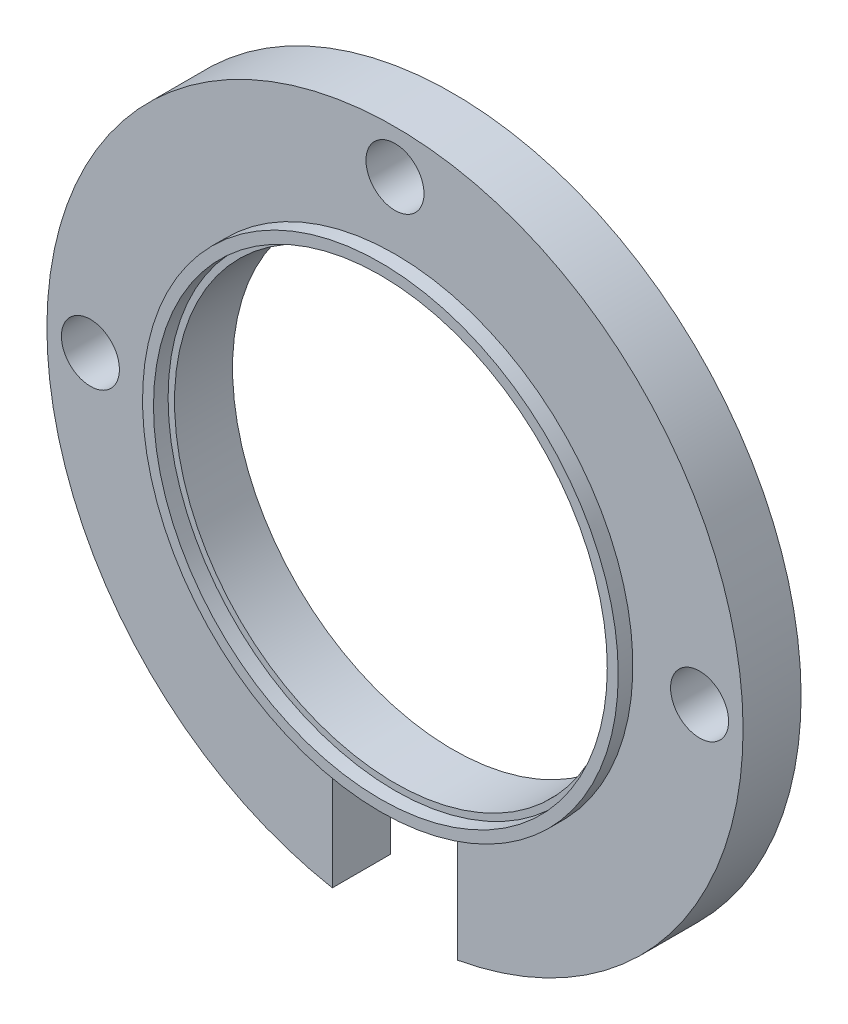
ISO-10303-21;
HEADER;
FILE_DESCRIPTION(('STEP AP214'),'2;1');
FILE_NAME('part.step','',(''),(''),'','','');
FILE_SCHEMA(('AUTOMOTIVE_DESIGN { 1 0 10303 214 1 1 1 1 }'));
ENDSEC;
DATA;
#1=APPLICATION_CONTEXT('core data for automotive mechanical design processes');
#2=APPLICATION_PROTOCOL_DEFINITION('international standard','automotive_design',2000,#1);
#3=PRODUCT_CONTEXT('',#1,'mechanical');
#4=PRODUCT('Part','Part','',(#3));
#5=PRODUCT_RELATED_PRODUCT_CATEGORY('part','',(#4));
#6=PRODUCT_DEFINITION_FORMATION('','',#4);
#7=PRODUCT_DEFINITION_CONTEXT('part definition',#1,'design');
#8=PRODUCT_DEFINITION('design','',#6,#7);
#9=PRODUCT_DEFINITION_SHAPE('','',#8);
#10=(LENGTH_UNIT() NAMED_UNIT(*) SI_UNIT(.MILLI.,.METRE.));
#11=(NAMED_UNIT(*) PLANE_ANGLE_UNIT() SI_UNIT($,.RADIAN.));
#12=(NAMED_UNIT(*) SI_UNIT($,.STERADIAN.) SOLID_ANGLE_UNIT());
#13=UNCERTAINTY_MEASURE_WITH_UNIT(LENGTH_MEASURE(1.E-05),#10,'distance_accuracy_value','');
#14=(GEOMETRIC_REPRESENTATION_CONTEXT(3) GLOBAL_UNCERTAINTY_ASSIGNED_CONTEXT((#13)) GLOBAL_UNIT_ASSIGNED_CONTEXT((#10,
#11,#12)) REPRESENTATION_CONTEXT('',''));
#15=CARTESIAN_POINT('',(0.,0.,0.));
#16=DIRECTION('',(0.,0.,1.));
#17=DIRECTION('',(1.,0.,0.));
#18=AXIS2_PLACEMENT_3D('',#15,#16,#17);
#19=CARTESIAN_POINT('',(0.,0.,3.175));
#20=DIRECTION('',(0.,0.,1.));
#21=DIRECTION('',(1.,0.,0.));
#22=AXIS2_PLACEMENT_3D('',#19,#20,#21);
#23=PLANE('',#22);
#24=CARTESIAN_POINT('',(0.,16.66875,3.175));
#25=DIRECTION('',(0.,0.,1.));
#26=DIRECTION('',(1.,0.,0.));
#27=AXIS2_PLACEMENT_3D('',#24,#25,#26);
#28=CIRCLE('',#27,1.5875);
#29=CARTESIAN_POINT('',(1.5875,16.66875,3.175));
#30=VERTEX_POINT('',#29);
#31=EDGE_CURVE('E156',#30,#30,#28,.T.);
#32=ORIENTED_EDGE('',*,*,#31,.F.);
#33=EDGE_LOOP('',(#32));
#34=FACE_BOUND('',#33,.T.);
#35=CARTESIAN_POINT('',(-16.66875,0.,3.175));
#36=DIRECTION('',(0.,0.,1.));
#37=DIRECTION('',(1.,0.,0.));
#38=AXIS2_PLACEMENT_3D('',#35,#36,#37);
#39=CIRCLE('',#38,1.5875);
#40=CARTESIAN_POINT('',(-15.08125,0.,3.175));
#41=VERTEX_POINT('',#40);
#42=EDGE_CURVE('E159',#41,#41,#39,.T.);
#43=ORIENTED_EDGE('',*,*,#42,.F.);
#44=EDGE_LOOP('',(#43));
#45=FACE_BOUND('',#44,.T.);
#46=CARTESIAN_POINT('',(16.66875,0.,3.175));
#47=DIRECTION('',(0.,0.,1.));
#48=DIRECTION('',(1.,0.,0.));
#49=AXIS2_PLACEMENT_3D('',#46,#47,#48);
#50=CIRCLE('',#49,1.5875);
#51=CARTESIAN_POINT('',(18.25625,0.,3.175));
#52=VERTEX_POINT('',#51);
#53=EDGE_CURVE('E147',#52,#52,#50,.T.);
#54=ORIENTED_EDGE('',*,*,#53,.F.);
#55=EDGE_LOOP('',(#54));
#56=FACE_BOUND('',#55,.T.);
#57=DIRECTION('',(0.,1.,0.));
#58=VECTOR('',#57,1.);
#59=CARTESIAN_POINT('',(3.429,-25.0825,3.175));
#60=LINE('',#59,#58);
#61=CARTESIAN_POINT('',(3.429,-18.7388489240935,3.175));
#62=VERTEX_POINT('',#61);
#63=CARTESIAN_POINT('',(3.429,-13.0175,3.175));
#64=VERTEX_POINT('',#63);
#65=EDGE_CURVE('E82',#62,#64,#60,.T.);
#66=ORIENTED_EDGE('',*,*,#65,.F.);
#67=CARTESIAN_POINT('',(0.,0.,3.175));
#68=DIRECTION('',(0.,0.,1.));
#69=DIRECTION('',(1.,0.,0.));
#70=AXIS2_PLACEMENT_3D('',#67,#68,#69);
#71=CIRCLE('',#70,19.05);
#72=CARTESIAN_POINT('',(-3.429,-18.7388489240935,3.175));
#73=VERTEX_POINT('',#72);
#74=EDGE_CURVE('E100',#62,#73,#71,.T.);
#75=ORIENTED_EDGE('',*,*,#74,.T.);
#76=DIRECTION('',(0.,-1.,0.));
#77=VECTOR('',#76,1.);
#78=CARTESIAN_POINT('',(-3.429,-25.0825,3.175));
#79=LINE('',#78,#77);
#80=CARTESIAN_POINT('',(-3.429,-13.0175,3.175));
#81=VERTEX_POINT('',#80);
#82=EDGE_CURVE('E91',#81,#73,#79,.T.);
#83=ORIENTED_EDGE('',*,*,#82,.F.);
#84=DIRECTION('',(-1.,0.,0.));
#85=VECTOR('',#84,1.);
#86=CARTESIAN_POINT('',(-3.429,-13.0175,3.175));
#87=LINE('',#86,#85);
#88=CARTESIAN_POINT('',(0.,-13.0175,3.175));
#89=VERTEX_POINT('',#88);
#90=EDGE_CURVE('E145',#89,#81,#87,.T.);
#91=ORIENTED_EDGE('',*,*,#90,.F.);
#92=CARTESIAN_POINT('',(0.,0.,3.175));
#93=DIRECTION('',(0.,0.,1.));
#94=DIRECTION('',(1.,0.,0.));
#95=AXIS2_PLACEMENT_3D('',#92,#93,#94);
#96=CIRCLE('',#95,13.0175);
#97=EDGE_CURVE('E128',#89,#89,#96,.T.);
#98=ORIENTED_EDGE('',*,*,#97,.F.);
#99=EDGE_CURVE('E143',#64,#89,#87,.T.);
#100=ORIENTED_EDGE('',*,*,#99,.F.);
#101=EDGE_LOOP('',(#66,#75,#83,#91,#98,#100));
#102=FACE_BOUND('',#101,.T.);
#103=ADVANCED_FACE('F37',(#34,#45,#56,#102),#23,.T.);
#104=CARTESIAN_POINT('',(0.,0.,3.175));
#105=DIRECTION('',(0.,0.,-1.));
#106=DIRECTION('',(-1.,0.,0.));
#107=AXIS2_PLACEMENT_3D('',#104,#105,#106);
#108=CYLINDRICAL_SURFACE('',#107,19.05);
#109=ORIENTED_EDGE('',*,*,#74,.F.);
#110=DIRECTION('',(0.,0.,-1.));
#111=VECTOR('',#110,1.);
#112=CARTESIAN_POINT('',(3.429,-18.7388489240935,3.175));
#113=LINE('',#112,#111);
#114=CARTESIAN_POINT('',(3.429,-18.7388489240935,0.));
#115=VERTEX_POINT('',#114);
#116=EDGE_CURVE('E137',#62,#115,#113,.T.);
#117=ORIENTED_EDGE('',*,*,#116,.T.);
#118=CARTESIAN_POINT('',(0.,0.,0.));
#119=DIRECTION('',(0.,0.,1.));
#120=DIRECTION('',(1.,0.,0.));
#121=AXIS2_PLACEMENT_3D('',#118,#119,#120);
#122=CIRCLE('',#121,19.05);
#123=CARTESIAN_POINT('',(-3.429,-18.7388489240935,0.));
#124=VERTEX_POINT('',#123);
#125=EDGE_CURVE('E97',#115,#124,#122,.T.);
#126=ORIENTED_EDGE('',*,*,#125,.T.);
#127=DIRECTION('',(0.,0.,-1.));
#128=VECTOR('',#127,1.);
#129=CARTESIAN_POINT('',(-3.429,-18.7388489240935,3.175));
#130=LINE('',#129,#128);
#131=EDGE_CURVE('E139',#124,#73,#130,.F.);
#132=ORIENTED_EDGE('',*,*,#131,.T.);
#133=EDGE_LOOP('',(#109,#117,#126,#132));
#134=FACE_BOUND('',#133,.T.);
#135=ADVANCED_FACE('F39',(#134),#108,.T.);
#136=CARTESIAN_POINT('',(0.,0.,3.175));
#137=DIRECTION('',(0.,0.,1.));
#138=DIRECTION('',(1.,0.,0.));
#139=AXIS2_PLACEMENT_3D('',#136,#137,#138);
#140=CIRCLE('',#139,12.4175);
#141=CARTESIAN_POINT('',(12.4175,0.,3.175));
#142=VERTEX_POINT('',#141);
#143=EDGE_CURVE('E45',#142,#142,#140,.F.);
#144=ORIENTED_EDGE('',*,*,#143,.F.);
#145=EDGE_LOOP('',(#144));
#146=FACE_BOUND('',#145,.T.);
#147=CARTESIAN_POINT('',(0.,0.,3.175));
#148=DIRECTION('',(0.,0.,1.));
#149=DIRECTION('',(1.,0.,0.));
#150=AXIS2_PLACEMENT_3D('',#147,#148,#149);
#151=CIRCLE('',#150,12.065);
#152=CARTESIAN_POINT('',(12.065,0.,3.175));
#153=VERTEX_POINT('',#152);
#154=EDGE_CURVE('E107',#153,#153,#151,.T.);
#155=ORIENTED_EDGE('',*,*,#154,.F.);
#156=EDGE_LOOP('',(#155));
#157=FACE_BOUND('',#156,.T.);
#158=ADVANCED_FACE('F118',(#146,#157),#23,.T.);
#159=CARTESIAN_POINT('',(0.,0.,0.));
#160=DIRECTION('',(0.,0.,1.));
#161=DIRECTION('',(1.,0.,0.));
#162=AXIS2_PLACEMENT_3D('',#159,#160,#161);
#163=PLANE('',#162);
#164=CARTESIAN_POINT('',(0.,16.66875,0.));
#165=DIRECTION('',(0.,0.,-1.));
#166=DIRECTION('',(-1.,0.,0.));
#167=AXIS2_PLACEMENT_3D('',#164,#165,#166);
#168=CIRCLE('',#167,1.5875);
#169=CARTESIAN_POINT('',(-1.5875,16.66875,0.));
#170=VERTEX_POINT('',#169);
#171=EDGE_CURVE('E162',#170,#170,#168,.T.);
#172=ORIENTED_EDGE('',*,*,#171,.F.);
#173=EDGE_LOOP('',(#172));
#174=FACE_BOUND('',#173,.T.);
#175=CARTESIAN_POINT('',(-16.66875,0.,0.));
#176=DIRECTION('',(0.,0.,-1.));
#177=DIRECTION('',(-1.,0.,0.));
#178=AXIS2_PLACEMENT_3D('',#175,#176,#177);
#179=CIRCLE('',#178,1.5875);
#180=CARTESIAN_POINT('',(-18.25625,0.,0.));
#181=VERTEX_POINT('',#180);
#182=EDGE_CURVE('E163',#181,#181,#179,.T.);
#183=ORIENTED_EDGE('',*,*,#182,.F.);
#184=EDGE_LOOP('',(#183));
#185=FACE_BOUND('',#184,.T.);
#186=CARTESIAN_POINT('',(16.66875,0.,0.));
#187=DIRECTION('',(0.,0.,-1.));
#188=DIRECTION('',(-1.,0.,0.));
#189=AXIS2_PLACEMENT_3D('',#186,#187,#188);
#190=CIRCLE('',#189,1.5875);
#191=CARTESIAN_POINT('',(15.08125,0.,0.));
#192=VERTEX_POINT('',#191);
#193=EDGE_CURVE('E152',#192,#192,#190,.T.);
#194=ORIENTED_EDGE('',*,*,#193,.F.);
#195=EDGE_LOOP('',(#194));
#196=FACE_BOUND('',#195,.T.);
#197=ORIENTED_EDGE('',*,*,#125,.F.);
#198=DIRECTION('',(0.,1.,0.));
#199=VECTOR('',#198,1.);
#200=CARTESIAN_POINT('',(3.42899999999999,0.,0.));
#201=LINE('',#200,#199);
#202=CARTESIAN_POINT('',(3.429,-13.0175,0.));
#203=VERTEX_POINT('',#202);
#204=EDGE_CURVE('E11',#115,#203,#201,.T.);
#205=ORIENTED_EDGE('',*,*,#204,.T.);
#206=DIRECTION('',(-1.,0.,0.));
#207=VECTOR('',#206,1.);
#208=CARTESIAN_POINT('',(-3.429,-13.0175,0.));
#209=LINE('',#208,#207);
#210=CARTESIAN_POINT('',(-3.429,-13.0175,0.));
#211=VERTEX_POINT('',#210);
#212=EDGE_CURVE('E88',#203,#211,#209,.T.);
#213=ORIENTED_EDGE('',*,*,#212,.T.);
#214=DIRECTION('',(0.,-1.,0.));
#215=VECTOR('',#214,1.);
#216=CARTESIAN_POINT('',(-3.429,-25.0825,0.));
#217=LINE('',#216,#215);
#218=EDGE_CURVE('E52',#211,#124,#217,.T.);
#219=ORIENTED_EDGE('',*,*,#218,.T.);
#220=EDGE_LOOP('',(#197,#205,#213,#219));
#221=FACE_BOUND('',#220,.T.);
#222=CARTESIAN_POINT('',(0.,0.,0.));
#223=DIRECTION('',(0.,0.,1.));
#224=DIRECTION('',(1.,0.,0.));
#225=AXIS2_PLACEMENT_3D('',#222,#223,#224);
#226=CIRCLE('',#225,12.065);
#227=CARTESIAN_POINT('',(12.065,0.,0.));
#228=VERTEX_POINT('',#227);
#229=EDGE_CURVE('E101',#228,#228,#226,.T.);
#230=ORIENTED_EDGE('',*,*,#229,.T.);
#231=EDGE_LOOP('',(#230));
#232=FACE_BOUND('',#231,.T.);
#233=ADVANCED_FACE('F94',(#174,#185,#196,#221,#232),#163,.F.);
#234=CARTESIAN_POINT('',(0.,0.,0.));
#235=DIRECTION('',(0.,0.,1.));
#236=DIRECTION('',(1.,0.,0.));
#237=AXIS2_PLACEMENT_3D('',#234,#235,#236);
#238=CYLINDRICAL_SURFACE('',#237,12.065);
#239=ORIENTED_EDGE('',*,*,#229,.F.);
#240=EDGE_LOOP('',(#239));
#241=FACE_BOUND('',#240,.T.);
#242=ORIENTED_EDGE('',*,*,#154,.T.);
#243=EDGE_LOOP('',(#242));
#244=FACE_BOUND('',#243,.T.);
#245=ADVANCED_FACE('F173',(#241,#244),#238,.F.);
#246=CARTESIAN_POINT('',(0.,0.,3.974999924));
#247=DIRECTION('',(0.,0.,1.));
#248=DIRECTION('',(1.,0.,0.));
#249=AXIS2_PLACEMENT_3D('',#246,#247,#248);
#250=PLANE('',#249);
#251=CARTESIAN_POINT('',(0.,0.,3.974999924));
#252=DIRECTION('',(0.,0.,1.));
#253=DIRECTION('',(1.,0.,0.));
#254=AXIS2_PLACEMENT_3D('',#251,#252,#253);
#255=CIRCLE('',#254,13.0175);
#256=CARTESIAN_POINT('',(13.0175,0.,3.974999924));
#257=VERTEX_POINT('',#256);
#258=EDGE_CURVE('E125',#257,#257,#255,.T.);
#259=ORIENTED_EDGE('',*,*,#258,.T.);
#260=EDGE_LOOP('',(#259));
#261=FACE_BOUND('',#260,.T.);
#262=CARTESIAN_POINT('',(0.,0.,3.974999924));
#263=DIRECTION('',(0.,0.,1.));
#264=DIRECTION('',(1.,0.,0.));
#265=AXIS2_PLACEMENT_3D('',#262,#263,#264);
#266=CIRCLE('',#265,12.4175);
#267=CARTESIAN_POINT('',(12.4175,0.,3.974999924));
#268=VERTEX_POINT('',#267);
#269=EDGE_CURVE('E132',#268,#268,#266,.T.);
#270=ORIENTED_EDGE('',*,*,#269,.F.);
#271=EDGE_LOOP('',(#270));
#272=FACE_BOUND('',#271,.T.);
#273=ADVANCED_FACE('F202',(#261,#272),#250,.T.);
#274=CARTESIAN_POINT('',(0.,0.,3.974999924));
#275=DIRECTION('',(0.,0.,-1.));
#276=DIRECTION('',(-1.,0.,0.));
#277=AXIS2_PLACEMENT_3D('',#274,#275,#276);
#278=CYLINDRICAL_SURFACE('',#277,13.0175);
#279=ORIENTED_EDGE('',*,*,#258,.F.);
#280=EDGE_LOOP('',(#279));
#281=FACE_BOUND('',#280,.T.);
#282=ORIENTED_EDGE('',*,*,#97,.T.);
#283=EDGE_LOOP('',(#282));
#284=FACE_BOUND('',#283,.T.);
#285=ADVANCED_FACE('F204',(#281,#284),#278,.T.);
#286=CARTESIAN_POINT('',(0.,0.,3.974999924));
#287=DIRECTION('',(0.,0.,-1.));
#288=DIRECTION('',(-1.,0.,0.));
#289=AXIS2_PLACEMENT_3D('',#286,#287,#288);
#290=CYLINDRICAL_SURFACE('',#289,12.4175);
#291=ORIENTED_EDGE('',*,*,#269,.T.);
#292=EDGE_LOOP('',(#291));
#293=FACE_BOUND('',#292,.T.);
#294=ORIENTED_EDGE('',*,*,#143,.T.);
#295=EDGE_LOOP('',(#294));
#296=FACE_BOUND('',#295,.T.);
#297=ADVANCED_FACE('F116',(#293,#296),#290,.F.);
#298=CARTESIAN_POINT('',(3.429,-25.0825,0.));
#299=DIRECTION('',(1.,0.,0.));
#300=DIRECTION('',(0.,1.,0.));
#301=AXIS2_PLACEMENT_3D('',#298,#299,#300);
#302=PLANE('',#301);
#303=ORIENTED_EDGE('',*,*,#65,.T.);
#304=DIRECTION('',(0.,0.,1.));
#305=VECTOR('',#304,1.);
#306=CARTESIAN_POINT('',(3.429,-13.0175,0.));
#307=LINE('',#306,#305);
#308=EDGE_CURVE('E78',#203,#64,#307,.T.);
#309=ORIENTED_EDGE('',*,*,#308,.F.);
#310=ORIENTED_EDGE('',*,*,#204,.F.);
#311=ORIENTED_EDGE('',*,*,#116,.F.);
#312=EDGE_LOOP('',(#303,#309,#310,#311));
#313=FACE_BOUND('',#312,.T.);
#314=ADVANCED_FACE('F80',(#313),#302,.F.);
#315=CARTESIAN_POINT('',(-3.429,-25.0825,0.));
#316=DIRECTION('',(-1.,0.,0.));
#317=DIRECTION('',(0.,0.,1.));
#318=AXIS2_PLACEMENT_3D('',#315,#316,#317);
#319=PLANE('',#318);
#320=ORIENTED_EDGE('',*,*,#218,.F.);
#321=DIRECTION('',(0.,0.,1.));
#322=VECTOR('',#321,1.);
#323=CARTESIAN_POINT('',(-3.429,-13.0175,0.));
#324=LINE('',#323,#322);
#325=EDGE_CURVE('E85',#211,#81,#324,.T.);
#326=ORIENTED_EDGE('',*,*,#325,.T.);
#327=ORIENTED_EDGE('',*,*,#82,.T.);
#328=ORIENTED_EDGE('',*,*,#131,.F.);
#329=EDGE_LOOP('',(#320,#326,#327,#328));
#330=FACE_BOUND('',#329,.T.);
#331=ADVANCED_FACE('F189',(#330),#319,.F.);
#332=CARTESIAN_POINT('',(-3.429,-13.0175,0.));
#333=DIRECTION('',(0.,1.,0.));
#334=DIRECTION('',(-1.,0.,0.));
#335=AXIS2_PLACEMENT_3D('',#332,#333,#334);
#336=PLANE('',#335);
#337=ORIENTED_EDGE('',*,*,#99,.T.);
#338=ORIENTED_EDGE('',*,*,#90,.T.);
#339=ORIENTED_EDGE('',*,*,#325,.F.);
#340=ORIENTED_EDGE('',*,*,#212,.F.);
#341=ORIENTED_EDGE('',*,*,#308,.T.);
#342=EDGE_LOOP('',(#337,#338,#339,#340,#341));
#343=FACE_BOUND('',#342,.T.);
#344=ADVANCED_FACE('F89',(#343),#336,.F.);
#345=CARTESIAN_POINT('',(16.66875,0.,3.974999924));
#346=DIRECTION('',(0.,0.,-1.));
#347=DIRECTION('',(-1.,0.,0.));
#348=AXIS2_PLACEMENT_3D('',#345,#346,#347);
#349=CYLINDRICAL_SURFACE('',#348,1.5875);
#350=ORIENTED_EDGE('',*,*,#53,.T.);
#351=EDGE_LOOP('',(#350));
#352=FACE_BOUND('',#351,.T.);
#353=ORIENTED_EDGE('',*,*,#193,.T.);
#354=EDGE_LOOP('',(#353));
#355=FACE_BOUND('',#354,.T.);
#356=ADVANCED_FACE('F178',(#352,#355),#349,.F.);
#357=CARTESIAN_POINT('',(-16.66875,0.,3.974999924));
#358=DIRECTION('',(0.,0.,-1.));
#359=DIRECTION('',(-1.,0.,0.));
#360=AXIS2_PLACEMENT_3D('',#357,#358,#359);
#361=CYLINDRICAL_SURFACE('',#360,1.5875);
#362=ORIENTED_EDGE('',*,*,#42,.T.);
#363=EDGE_LOOP('',(#362));
#364=FACE_BOUND('',#363,.T.);
#365=ORIENTED_EDGE('',*,*,#182,.T.);
#366=EDGE_LOOP('',(#365));
#367=FACE_BOUND('',#366,.T.);
#368=ADVANCED_FACE('F180',(#364,#367),#361,.F.);
#369=CARTESIAN_POINT('',(0.,16.66875,3.974999924));
#370=DIRECTION('',(0.,0.,-1.));
#371=DIRECTION('',(-1.,0.,0.));
#372=AXIS2_PLACEMENT_3D('',#369,#370,#371);
#373=CYLINDRICAL_SURFACE('',#372,1.5875);
#374=ORIENTED_EDGE('',*,*,#31,.T.);
#375=EDGE_LOOP('',(#374));
#376=FACE_BOUND('',#375,.T.);
#377=ORIENTED_EDGE('',*,*,#171,.T.);
#378=EDGE_LOOP('',(#377));
#379=FACE_BOUND('',#378,.T.);
#380=ADVANCED_FACE('F169',(#376,#379),#373,.F.);
#381=CLOSED_SHELL('',(#103,#135,#158,#233,#245,#273,#285,#297,#314,#331,#344,#356,#368,#380));
#382=MANIFOLD_SOLID_BREP('B2',#381);
#383=ADVANCED_BREP_SHAPE_REPRESENTATION('',(#18,#382),#14);
#384=SHAPE_DEFINITION_REPRESENTATION(#9,#383);
ENDSEC;
END-ISO-10303-21;
